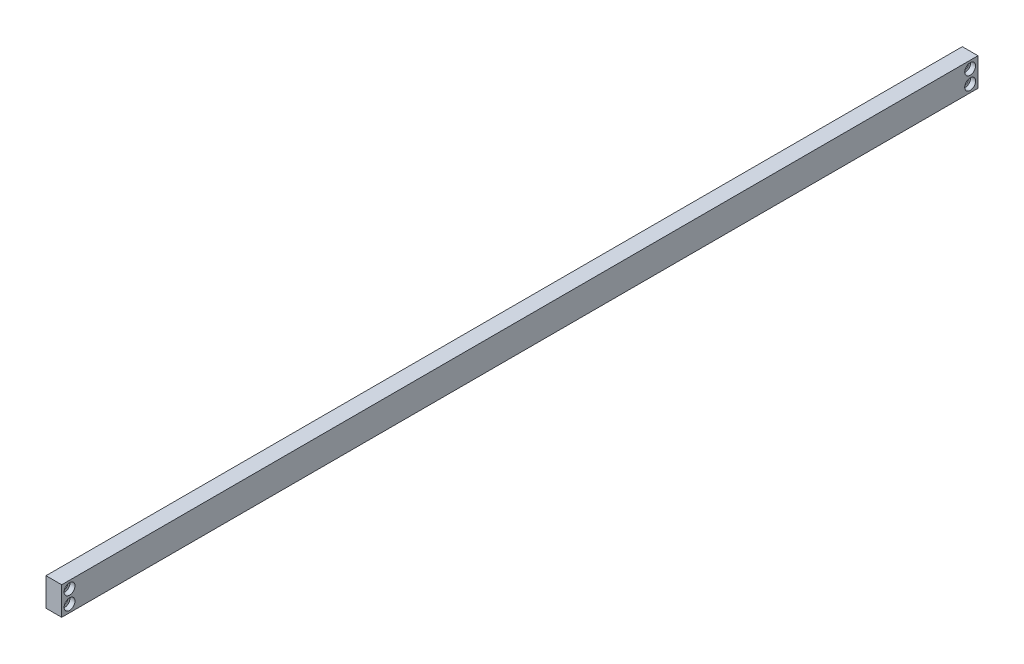
ISO-10303-21;
HEADER;
FILE_DESCRIPTION(('STEP AP214'),'2;1');
FILE_NAME('part.step','',(''),(''),'','','');
FILE_SCHEMA(('AUTOMOTIVE_DESIGN { 1 0 10303 214 1 1 1 1 }'));
ENDSEC;
DATA;
#1=APPLICATION_CONTEXT('core data for automotive mechanical design processes');
#2=APPLICATION_PROTOCOL_DEFINITION('international standard','automotive_design',2000,#1);
#3=PRODUCT_CONTEXT('',#1,'mechanical');
#4=PRODUCT('Part','Part','',(#3));
#5=PRODUCT_RELATED_PRODUCT_CATEGORY('part','',(#4));
#6=PRODUCT_DEFINITION_FORMATION('','',#4);
#7=PRODUCT_DEFINITION_CONTEXT('part definition',#1,'design');
#8=PRODUCT_DEFINITION('design','',#6,#7);
#9=PRODUCT_DEFINITION_SHAPE('','',#8);
#10=(LENGTH_UNIT() NAMED_UNIT(*) SI_UNIT(.MILLI.,.METRE.));
#11=(NAMED_UNIT(*) PLANE_ANGLE_UNIT() SI_UNIT($,.RADIAN.));
#12=(NAMED_UNIT(*) SI_UNIT($,.STERADIAN.) SOLID_ANGLE_UNIT());
#13=UNCERTAINTY_MEASURE_WITH_UNIT(LENGTH_MEASURE(1.E-05),#10,'distance_accuracy_value','');
#14=(GEOMETRIC_REPRESENTATION_CONTEXT(3) GLOBAL_UNCERTAINTY_ASSIGNED_CONTEXT((#13)) GLOBAL_UNIT_ASSIGNED_CONTEXT((#10,
#11,#12)) REPRESENTATION_CONTEXT('',''));
#15=CARTESIAN_POINT('',(0.,0.,0.));
#16=DIRECTION('',(0.,0.,1.));
#17=DIRECTION('',(1.,0.,0.));
#18=AXIS2_PLACEMENT_3D('',#15,#16,#17);
#19=CARTESIAN_POINT('',(0.,0.,-370.84));
#20=DIRECTION('',(-1.,0.,0.));
#21=DIRECTION('',(0.,0.,1.));
#22=AXIS2_PLACEMENT_3D('',#19,#20,#21);
#23=PLANE('',#22);
#24=CARTESIAN_POINT('',(0.,8.382,-367.665));
#25=DIRECTION('',(1.,0.,0.));
#26=DIRECTION('',(0.,0.,-1.));
#27=AXIS2_PLACEMENT_3D('',#24,#25,#26);
#28=CIRCLE('',#27,1.2);
#29=CARTESIAN_POINT('',(0.,8.382,-368.865));
#30=VERTEX_POINT('',#29);
#31=EDGE_CURVE('E214',#30,#30,#28,.T.);
#32=ORIENTED_EDGE('',*,*,#31,.T.);
#33=EDGE_LOOP('',(#32));
#34=FACE_BOUND('',#33,.T.);
#35=CARTESIAN_POINT('',(0.,3.048,-367.665));
#36=DIRECTION('',(1.,0.,0.));
#37=DIRECTION('',(0.,0.,-1.));
#38=AXIS2_PLACEMENT_3D('',#35,#36,#37);
#39=CIRCLE('',#38,1.2);
#40=CARTESIAN_POINT('',(0.,3.048,-368.865));
#41=VERTEX_POINT('',#40);
#42=EDGE_CURVE('E230',#41,#41,#39,.T.);
#43=ORIENTED_EDGE('',*,*,#42,.T.);
#44=EDGE_LOOP('',(#43));
#45=FACE_BOUND('',#44,.T.);
#46=CARTESIAN_POINT('',(0.,8.382,-3.17499999999998));
#47=DIRECTION('',(1.,0.,0.));
#48=DIRECTION('',(0.,0.,-1.));
#49=AXIS2_PLACEMENT_3D('',#46,#47,#48);
#50=CIRCLE('',#49,1.2);
#51=CARTESIAN_POINT('',(0.,8.382,-4.37499999999998));
#52=VERTEX_POINT('',#51);
#53=EDGE_CURVE('E246',#52,#52,#50,.T.);
#54=ORIENTED_EDGE('',*,*,#53,.T.);
#55=EDGE_LOOP('',(#54));
#56=FACE_BOUND('',#55,.T.);
#57=CARTESIAN_POINT('',(0.,3.048,-3.17499999999998));
#58=DIRECTION('',(1.,0.,0.));
#59=DIRECTION('',(0.,0.,-1.));
#60=AXIS2_PLACEMENT_3D('',#57,#58,#59);
#61=CIRCLE('',#60,1.2);
#62=CARTESIAN_POINT('',(0.,3.048,-4.37499999999998));
#63=VERTEX_POINT('',#62);
#64=EDGE_CURVE('E117',#63,#63,#61,.T.);
#65=ORIENTED_EDGE('',*,*,#64,.T.);
#66=EDGE_LOOP('',(#65));
#67=FACE_BOUND('',#66,.T.);
#68=DIRECTION('',(0.,-1.,0.));
#69=VECTOR('',#68,1.);
#70=CARTESIAN_POINT('',(0.,0.,0.));
#71=LINE('',#70,#69);
#72=CARTESIAN_POINT('',(0.,11.43,0.));
#73=VERTEX_POINT('',#72);
#74=CARTESIAN_POINT('',(0.,0.,0.));
#75=VERTEX_POINT('',#74);
#76=EDGE_CURVE('E112',#73,#75,#71,.T.);
#77=ORIENTED_EDGE('',*,*,#76,.F.);
#78=DIRECTION('',(0.,0.,1.));
#79=VECTOR('',#78,1.);
#80=CARTESIAN_POINT('',(0.,11.43,-370.84));
#81=LINE('',#80,#79);
#82=CARTESIAN_POINT('',(0.,11.43,-370.84));
#83=VERTEX_POINT('',#82);
#84=EDGE_CURVE('E11',#83,#73,#81,.T.);
#85=ORIENTED_EDGE('',*,*,#84,.F.);
#86=DIRECTION('',(0.,-1.,0.));
#87=VECTOR('',#86,1.);
#88=CARTESIAN_POINT('',(0.,0.,-370.84));
#89=LINE('',#88,#87);
#90=CARTESIAN_POINT('',(0.,0.,-370.84));
#91=VERTEX_POINT('',#90);
#92=EDGE_CURVE('E103',#83,#91,#89,.T.);
#93=ORIENTED_EDGE('',*,*,#92,.T.);
#94=DIRECTION('',(0.,0.,1.));
#95=VECTOR('',#94,1.);
#96=CARTESIAN_POINT('',(0.,0.,-370.84));
#97=LINE('',#96,#95);
#98=EDGE_CURVE('E44',#91,#75,#97,.T.);
#99=ORIENTED_EDGE('',*,*,#98,.T.);
#100=EDGE_LOOP('',(#77,#85,#93,#99));
#101=FACE_BOUND('',#100,.T.);
#102=ADVANCED_FACE('F41',(#34,#45,#56,#67,#101),#23,.T.);
#103=CARTESIAN_POINT('',(0.,11.43,-370.84));
#104=DIRECTION('',(0.,1.,0.));
#105=DIRECTION('',(0.,0.,1.));
#106=AXIS2_PLACEMENT_3D('',#103,#104,#105);
#107=PLANE('',#106);
#108=DIRECTION('',(-1.,0.,0.));
#109=VECTOR('',#108,1.);
#110=CARTESIAN_POINT('',(0.,11.43,0.));
#111=LINE('',#110,#109);
#112=CARTESIAN_POINT('',(6.35,11.43,0.));
#113=VERTEX_POINT('',#112);
#114=EDGE_CURVE('E106',#113,#73,#111,.T.);
#115=ORIENTED_EDGE('',*,*,#114,.F.);
#116=DIRECTION('',(0.,0.,1.));
#117=VECTOR('',#116,1.);
#118=CARTESIAN_POINT('',(6.35,11.43,-370.84));
#119=LINE('',#118,#117);
#120=CARTESIAN_POINT('',(6.35,11.43,-370.84));
#121=VERTEX_POINT('',#120);
#122=EDGE_CURVE('E51',#121,#113,#119,.T.);
#123=ORIENTED_EDGE('',*,*,#122,.F.);
#124=DIRECTION('',(-1.,0.,0.));
#125=VECTOR('',#124,1.);
#126=CARTESIAN_POINT('',(0.,11.43,-370.84));
#127=LINE('',#126,#125);
#128=EDGE_CURVE('E98',#121,#83,#127,.T.);
#129=ORIENTED_EDGE('',*,*,#128,.T.);
#130=ORIENTED_EDGE('',*,*,#84,.T.);
#131=EDGE_LOOP('',(#115,#123,#129,#130));
#132=FACE_BOUND('',#131,.T.);
#133=ADVANCED_FACE('F129',(#132),#107,.T.);
#134=CARTESIAN_POINT('',(6.35,0.,-370.84));
#135=DIRECTION('',(1.,0.,0.));
#136=DIRECTION('',(0.,0.,-1.));
#137=AXIS2_PLACEMENT_3D('',#134,#135,#136);
#138=PLANE('',#137);
#139=CARTESIAN_POINT('',(6.35,8.382,-367.665));
#140=DIRECTION('',(1.,0.,0.));
#141=DIRECTION('',(0.,0.,-1.));
#142=AXIS2_PLACEMENT_3D('',#139,#140,#141);
#143=CIRCLE('',#142,2.2);
#144=CARTESIAN_POINT('',(6.35,8.382,-369.865));
#145=VERTEX_POINT('',#144);
#146=EDGE_CURVE('E204',#145,#145,#143,.T.);
#147=ORIENTED_EDGE('',*,*,#146,.F.);
#148=EDGE_LOOP('',(#147));
#149=FACE_BOUND('',#148,.T.);
#150=CARTESIAN_POINT('',(6.35,3.048,-367.665));
#151=DIRECTION('',(1.,0.,0.));
#152=DIRECTION('',(0.,0.,-1.));
#153=AXIS2_PLACEMENT_3D('',#150,#151,#152);
#154=CIRCLE('',#153,2.2);
#155=CARTESIAN_POINT('',(6.35,3.048,-369.865));
#156=VERTEX_POINT('',#155);
#157=EDGE_CURVE('E218',#156,#156,#154,.T.);
#158=ORIENTED_EDGE('',*,*,#157,.F.);
#159=EDGE_LOOP('',(#158));
#160=FACE_BOUND('',#159,.T.);
#161=CARTESIAN_POINT('',(6.35,8.382,-3.17499999999998));
#162=DIRECTION('',(1.,0.,0.));
#163=DIRECTION('',(0.,0.,-1.));
#164=AXIS2_PLACEMENT_3D('',#161,#162,#163);
#165=CIRCLE('',#164,2.2);
#166=CARTESIAN_POINT('',(6.35,8.382,-5.37499999999998));
#167=VERTEX_POINT('',#166);
#168=EDGE_CURVE('E234',#167,#167,#165,.T.);
#169=ORIENTED_EDGE('',*,*,#168,.F.);
#170=EDGE_LOOP('',(#169));
#171=FACE_BOUND('',#170,.T.);
#172=CARTESIAN_POINT('',(6.35,3.048,-3.17499999999998));
#173=DIRECTION('',(1.,0.,0.));
#174=DIRECTION('',(0.,0.,-1.));
#175=AXIS2_PLACEMENT_3D('',#172,#173,#174);
#176=CIRCLE('',#175,2.2);
#177=CARTESIAN_POINT('',(6.35,3.048,-5.37499999999998));
#178=VERTEX_POINT('',#177);
#179=EDGE_CURVE('E250',#178,#178,#176,.T.);
#180=ORIENTED_EDGE('',*,*,#179,.F.);
#181=EDGE_LOOP('',(#180));
#182=FACE_BOUND('',#181,.T.);
#183=DIRECTION('',(0.,1.,0.));
#184=VECTOR('',#183,1.);
#185=CARTESIAN_POINT('',(6.35,0.,0.));
#186=LINE('',#185,#184);
#187=CARTESIAN_POINT('',(6.35,0.,0.));
#188=VERTEX_POINT('',#187);
#189=EDGE_CURVE('E92',#188,#113,#186,.T.);
#190=ORIENTED_EDGE('',*,*,#189,.F.);
#191=DIRECTION('',(0.,0.,1.));
#192=VECTOR('',#191,1.);
#193=CARTESIAN_POINT('',(6.35,0.,-370.84));
#194=LINE('',#193,#192);
#195=CARTESIAN_POINT('',(6.35,0.,-370.84));
#196=VERTEX_POINT('',#195);
#197=EDGE_CURVE('E87',#196,#188,#194,.T.);
#198=ORIENTED_EDGE('',*,*,#197,.F.);
#199=DIRECTION('',(0.,1.,0.));
#200=VECTOR('',#199,1.);
#201=CARTESIAN_POINT('',(6.35,0.,-370.84));
#202=LINE('',#201,#200);
#203=EDGE_CURVE('E90',#196,#121,#202,.T.);
#204=ORIENTED_EDGE('',*,*,#203,.T.);
#205=ORIENTED_EDGE('',*,*,#122,.T.);
#206=EDGE_LOOP('',(#190,#198,#204,#205));
#207=FACE_BOUND('',#206,.T.);
#208=ADVANCED_FACE('F89',(#149,#160,#171,#182,#207),#138,.T.);
#209=CARTESIAN_POINT('',(0.,0.,-370.84));
#210=DIRECTION('',(0.,-1.,0.));
#211=DIRECTION('',(0.,0.,-1.));
#212=AXIS2_PLACEMENT_3D('',#209,#210,#211);
#213=PLANE('',#212);
#214=DIRECTION('',(1.,0.,0.));
#215=VECTOR('',#214,1.);
#216=CARTESIAN_POINT('',(0.,0.,0.));
#217=LINE('',#216,#215);
#218=EDGE_CURVE('E116',#75,#188,#217,.T.);
#219=ORIENTED_EDGE('',*,*,#218,.F.);
#220=ORIENTED_EDGE('',*,*,#98,.F.);
#221=DIRECTION('',(1.,0.,0.));
#222=VECTOR('',#221,1.);
#223=CARTESIAN_POINT('',(0.,0.,-370.84));
#224=LINE('',#223,#222);
#225=EDGE_CURVE('E97',#91,#196,#224,.T.);
#226=ORIENTED_EDGE('',*,*,#225,.T.);
#227=ORIENTED_EDGE('',*,*,#197,.T.);
#228=EDGE_LOOP('',(#219,#220,#226,#227));
#229=FACE_BOUND('',#228,.T.);
#230=ADVANCED_FACE('F101',(#229),#213,.T.);
#231=CARTESIAN_POINT('',(0.,0.,-370.84));
#232=DIRECTION('',(0.,0.,-1.));
#233=DIRECTION('',(-1.,0.,0.));
#234=AXIS2_PLACEMENT_3D('',#231,#232,#233);
#235=PLANE('',#234);
#236=ORIENTED_EDGE('',*,*,#92,.F.);
#237=ORIENTED_EDGE('',*,*,#128,.F.);
#238=ORIENTED_EDGE('',*,*,#203,.F.);
#239=ORIENTED_EDGE('',*,*,#225,.F.);
#240=EDGE_LOOP('',(#236,#237,#238,#239));
#241=FACE_BOUND('',#240,.T.);
#242=ADVANCED_FACE('F96',(#241),#235,.T.);
#243=CARTESIAN_POINT('',(0.,0.,0.));
#244=DIRECTION('',(0.,0.,-1.));
#245=DIRECTION('',(-1.,0.,0.));
#246=AXIS2_PLACEMENT_3D('',#243,#244,#245);
#247=PLANE('',#246);
#248=ORIENTED_EDGE('',*,*,#76,.T.);
#249=ORIENTED_EDGE('',*,*,#218,.T.);
#250=ORIENTED_EDGE('',*,*,#189,.T.);
#251=ORIENTED_EDGE('',*,*,#114,.T.);
#252=EDGE_LOOP('',(#248,#249,#250,#251));
#253=FACE_BOUND('',#252,.T.);
#254=ADVANCED_FACE('F128',(#253),#247,.F.);
#255=CARTESIAN_POINT('',(6.35,3.048,-3.17499999999998));
#256=DIRECTION('',(1.,0.,0.));
#257=DIRECTION('',(0.,0.,-1.));
#258=AXIS2_PLACEMENT_3D('',#255,#256,#257);
#259=CYLINDRICAL_SURFACE('',#258,1.2);
#260=ORIENTED_EDGE('',*,*,#64,.F.);
#261=EDGE_LOOP('',(#260));
#262=FACE_BOUND('',#261,.T.);
#263=CARTESIAN_POINT('',(4.35,3.048,-3.17499999999998));
#264=DIRECTION('',(1.,0.,0.));
#265=DIRECTION('',(0.,0.,-1.));
#266=AXIS2_PLACEMENT_3D('',#263,#264,#265);
#267=CIRCLE('',#266,1.2);
#268=CARTESIAN_POINT('',(4.35,3.048,-4.37499999999998));
#269=VERTEX_POINT('',#268);
#270=EDGE_CURVE('E258',#269,#269,#267,.T.);
#271=ORIENTED_EDGE('',*,*,#270,.T.);
#272=EDGE_LOOP('',(#271));
#273=FACE_BOUND('',#272,.T.);
#274=ADVANCED_FACE('F148',(#262,#273),#259,.F.);
#275=CARTESIAN_POINT('',(4.35,4.248,-3.17499999999998));
#276=DIRECTION('',(-1.,0.,0.));
#277=DIRECTION('',(0.,0.,1.));
#278=AXIS2_PLACEMENT_3D('',#275,#276,#277);
#279=PLANE('',#278);
#280=ORIENTED_EDGE('',*,*,#270,.F.);
#281=EDGE_LOOP('',(#280));
#282=FACE_BOUND('',#281,.T.);
#283=CARTESIAN_POINT('',(4.35,3.048,-3.17499999999998));
#284=DIRECTION('',(1.,0.,0.));
#285=DIRECTION('',(0.,0.,-1.));
#286=AXIS2_PLACEMENT_3D('',#283,#284,#285);
#287=CIRCLE('',#286,2.2);
#288=CARTESIAN_POINT('',(4.35,3.048,-5.37499999999998));
#289=VERTEX_POINT('',#288);
#290=EDGE_CURVE('E254',#289,#289,#287,.T.);
#291=ORIENTED_EDGE('',*,*,#290,.T.);
#292=EDGE_LOOP('',(#291));
#293=FACE_BOUND('',#292,.T.);
#294=ADVANCED_FACE('F152',(#282,#293),#279,.F.);
#295=CARTESIAN_POINT('',(6.35,3.048,-3.17499999999998));
#296=DIRECTION('',(1.,0.,0.));
#297=DIRECTION('',(0.,0.,-1.));
#298=AXIS2_PLACEMENT_3D('',#295,#296,#297);
#299=CYLINDRICAL_SURFACE('',#298,2.2);
#300=ORIENTED_EDGE('',*,*,#290,.F.);
#301=EDGE_LOOP('',(#300));
#302=FACE_BOUND('',#301,.T.);
#303=ORIENTED_EDGE('',*,*,#179,.T.);
#304=EDGE_LOOP('',(#303));
#305=FACE_BOUND('',#304,.T.);
#306=ADVANCED_FACE('F156',(#302,#305),#299,.F.);
#307=CARTESIAN_POINT('',(6.35,8.382,-3.17499999999998));
#308=DIRECTION('',(1.,0.,0.));
#309=DIRECTION('',(0.,0.,-1.));
#310=AXIS2_PLACEMENT_3D('',#307,#308,#309);
#311=CYLINDRICAL_SURFACE('',#310,1.2);
#312=ORIENTED_EDGE('',*,*,#53,.F.);
#313=EDGE_LOOP('',(#312));
#314=FACE_BOUND('',#313,.T.);
#315=CARTESIAN_POINT('',(4.35,8.382,-3.17499999999998));
#316=DIRECTION('',(1.,0.,0.));
#317=DIRECTION('',(0.,0.,-1.));
#318=AXIS2_PLACEMENT_3D('',#315,#316,#317);
#319=CIRCLE('',#318,1.2);
#320=CARTESIAN_POINT('',(4.35,8.382,-4.37499999999998));
#321=VERTEX_POINT('',#320);
#322=EDGE_CURVE('E242',#321,#321,#319,.T.);
#323=ORIENTED_EDGE('',*,*,#322,.T.);
#324=EDGE_LOOP('',(#323));
#325=FACE_BOUND('',#324,.T.);
#326=ADVANCED_FACE('F160',(#314,#325),#311,.F.);
#327=CARTESIAN_POINT('',(4.35,9.582,-3.17499999999998));
#328=DIRECTION('',(-1.,0.,0.));
#329=DIRECTION('',(0.,0.,1.));
#330=AXIS2_PLACEMENT_3D('',#327,#328,#329);
#331=PLANE('',#330);
#332=ORIENTED_EDGE('',*,*,#322,.F.);
#333=EDGE_LOOP('',(#332));
#334=FACE_BOUND('',#333,.T.);
#335=CARTESIAN_POINT('',(4.35,8.382,-3.17499999999998));
#336=DIRECTION('',(1.,0.,0.));
#337=DIRECTION('',(0.,0.,-1.));
#338=AXIS2_PLACEMENT_3D('',#335,#336,#337);
#339=CIRCLE('',#338,2.2);
#340=CARTESIAN_POINT('',(4.35,8.382,-5.37499999999998));
#341=VERTEX_POINT('',#340);
#342=EDGE_CURVE('E238',#341,#341,#339,.T.);
#343=ORIENTED_EDGE('',*,*,#342,.T.);
#344=EDGE_LOOP('',(#343));
#345=FACE_BOUND('',#344,.T.);
#346=ADVANCED_FACE('F164',(#334,#345),#331,.F.);
#347=CARTESIAN_POINT('',(6.35,8.382,-3.17499999999998));
#348=DIRECTION('',(1.,0.,0.));
#349=DIRECTION('',(0.,0.,-1.));
#350=AXIS2_PLACEMENT_3D('',#347,#348,#349);
#351=CYLINDRICAL_SURFACE('',#350,2.2);
#352=ORIENTED_EDGE('',*,*,#342,.F.);
#353=EDGE_LOOP('',(#352));
#354=FACE_BOUND('',#353,.T.);
#355=ORIENTED_EDGE('',*,*,#168,.T.);
#356=EDGE_LOOP('',(#355));
#357=FACE_BOUND('',#356,.T.);
#358=ADVANCED_FACE('F168',(#354,#357),#351,.F.);
#359=CARTESIAN_POINT('',(6.35,3.048,-367.665));
#360=DIRECTION('',(1.,0.,0.));
#361=DIRECTION('',(0.,0.,-1.));
#362=AXIS2_PLACEMENT_3D('',#359,#360,#361);
#363=CYLINDRICAL_SURFACE('',#362,1.2);
#364=ORIENTED_EDGE('',*,*,#42,.F.);
#365=EDGE_LOOP('',(#364));
#366=FACE_BOUND('',#365,.T.);
#367=CARTESIAN_POINT('',(4.35,3.048,-367.665));
#368=DIRECTION('',(1.,0.,0.));
#369=DIRECTION('',(0.,0.,-1.));
#370=AXIS2_PLACEMENT_3D('',#367,#368,#369);
#371=CIRCLE('',#370,1.2);
#372=CARTESIAN_POINT('',(4.35,3.048,-368.865));
#373=VERTEX_POINT('',#372);
#374=EDGE_CURVE('E226',#373,#373,#371,.T.);
#375=ORIENTED_EDGE('',*,*,#374,.T.);
#376=EDGE_LOOP('',(#375));
#377=FACE_BOUND('',#376,.T.);
#378=ADVANCED_FACE('F172',(#366,#377),#363,.F.);
#379=CARTESIAN_POINT('',(4.35,4.248,-367.665));
#380=DIRECTION('',(-1.,0.,0.));
#381=DIRECTION('',(0.,0.,1.));
#382=AXIS2_PLACEMENT_3D('',#379,#380,#381);
#383=PLANE('',#382);
#384=ORIENTED_EDGE('',*,*,#374,.F.);
#385=EDGE_LOOP('',(#384));
#386=FACE_BOUND('',#385,.T.);
#387=CARTESIAN_POINT('',(4.35,3.048,-367.665));
#388=DIRECTION('',(1.,0.,0.));
#389=DIRECTION('',(0.,0.,-1.));
#390=AXIS2_PLACEMENT_3D('',#387,#388,#389);
#391=CIRCLE('',#390,2.2);
#392=CARTESIAN_POINT('',(4.35,3.048,-369.865));
#393=VERTEX_POINT('',#392);
#394=EDGE_CURVE('E222',#393,#393,#391,.T.);
#395=ORIENTED_EDGE('',*,*,#394,.T.);
#396=EDGE_LOOP('',(#395));
#397=FACE_BOUND('',#396,.T.);
#398=ADVANCED_FACE('F176',(#386,#397),#383,.F.);
#399=CARTESIAN_POINT('',(6.35,3.048,-367.665));
#400=DIRECTION('',(1.,0.,0.));
#401=DIRECTION('',(0.,0.,-1.));
#402=AXIS2_PLACEMENT_3D('',#399,#400,#401);
#403=CYLINDRICAL_SURFACE('',#402,2.2);
#404=ORIENTED_EDGE('',*,*,#394,.F.);
#405=EDGE_LOOP('',(#404));
#406=FACE_BOUND('',#405,.T.);
#407=ORIENTED_EDGE('',*,*,#157,.T.);
#408=EDGE_LOOP('',(#407));
#409=FACE_BOUND('',#408,.T.);
#410=ADVANCED_FACE('F180',(#406,#409),#403,.F.);
#411=CARTESIAN_POINT('',(6.35,8.382,-367.665));
#412=DIRECTION('',(1.,0.,0.));
#413=DIRECTION('',(0.,0.,-1.));
#414=AXIS2_PLACEMENT_3D('',#411,#412,#413);
#415=CYLINDRICAL_SURFACE('',#414,1.2);
#416=ORIENTED_EDGE('',*,*,#31,.F.);
#417=EDGE_LOOP('',(#416));
#418=FACE_BOUND('',#417,.T.);
#419=CARTESIAN_POINT('',(4.35,8.382,-367.665));
#420=DIRECTION('',(1.,0.,0.));
#421=DIRECTION('',(0.,0.,-1.));
#422=AXIS2_PLACEMENT_3D('',#419,#420,#421);
#423=CIRCLE('',#422,1.2);
#424=CARTESIAN_POINT('',(4.35,8.382,-368.865));
#425=VERTEX_POINT('',#424);
#426=EDGE_CURVE('E208',#425,#425,#423,.T.);
#427=ORIENTED_EDGE('',*,*,#426,.T.);
#428=EDGE_LOOP('',(#427));
#429=FACE_BOUND('',#428,.T.);
#430=ADVANCED_FACE('F184',(#418,#429),#415,.F.);
#431=CARTESIAN_POINT('',(4.35,9.582,-367.665));
#432=DIRECTION('',(-1.,0.,0.));
#433=DIRECTION('',(0.,0.,1.));
#434=AXIS2_PLACEMENT_3D('',#431,#432,#433);
#435=PLANE('',#434);
#436=ORIENTED_EDGE('',*,*,#426,.F.);
#437=EDGE_LOOP('',(#436));
#438=FACE_BOUND('',#437,.T.);
#439=CARTESIAN_POINT('',(4.35,8.382,-367.665));
#440=DIRECTION('',(1.,0.,0.));
#441=DIRECTION('',(0.,0.,-1.));
#442=AXIS2_PLACEMENT_3D('',#439,#440,#441);
#443=CIRCLE('',#442,2.2);
#444=CARTESIAN_POINT('',(4.35,8.382,-369.865));
#445=VERTEX_POINT('',#444);
#446=EDGE_CURVE('E201',#445,#445,#443,.T.);
#447=ORIENTED_EDGE('',*,*,#446,.T.);
#448=EDGE_LOOP('',(#447));
#449=FACE_BOUND('',#448,.T.);
#450=ADVANCED_FACE('F188',(#438,#449),#435,.F.);
#451=CARTESIAN_POINT('',(6.35,8.382,-367.665));
#452=DIRECTION('',(1.,0.,0.));
#453=DIRECTION('',(0.,0.,-1.));
#454=AXIS2_PLACEMENT_3D('',#451,#452,#453);
#455=CYLINDRICAL_SURFACE('',#454,2.2);
#456=ORIENTED_EDGE('',*,*,#446,.F.);
#457=EDGE_LOOP('',(#456));
#458=FACE_BOUND('',#457,.T.);
#459=ORIENTED_EDGE('',*,*,#146,.T.);
#460=EDGE_LOOP('',(#459));
#461=FACE_BOUND('',#460,.T.);
#462=ADVANCED_FACE('F192',(#458,#461),#455,.F.);
#463=CLOSED_SHELL('',(#102,#133,#208,#230,#242,#254,#274,#294,#306,#326,#346,#358,#378,#398,
#410,#430,#450,#462));
#464=MANIFOLD_SOLID_BREP('B2',#463);
#465=ADVANCED_BREP_SHAPE_REPRESENTATION('',(#18,#464),#14);
#466=SHAPE_DEFINITION_REPRESENTATION(#9,#465);
ENDSEC;
END-ISO-10303-21;
